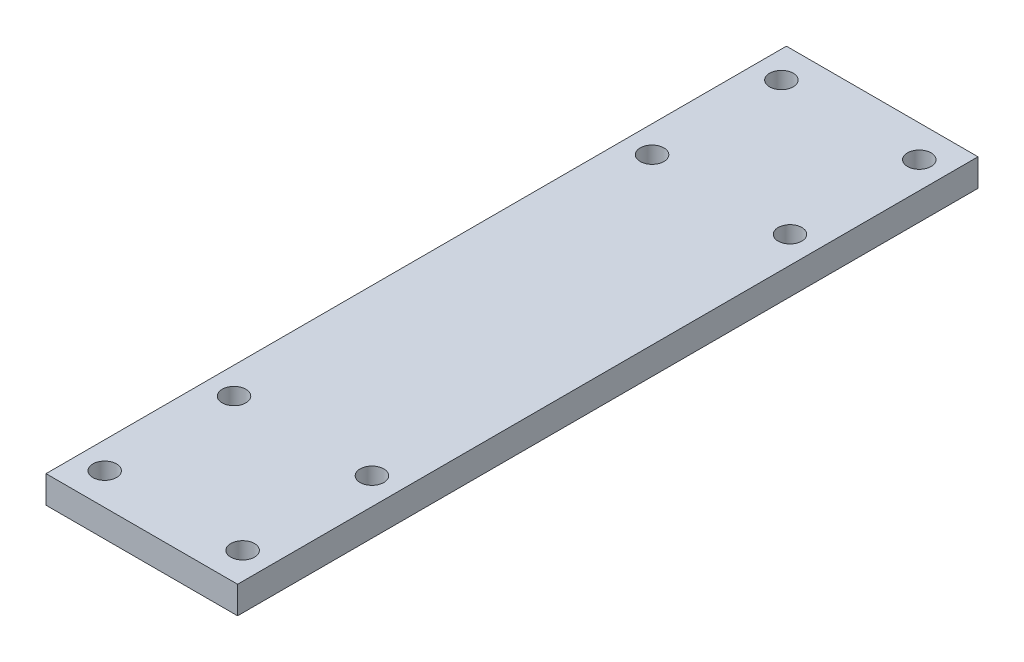
ISO-10303-21;
HEADER;
FILE_DESCRIPTION(('STEP AP214'),'2;1');
FILE_NAME('part.step','',(''),(''),'','','');
FILE_SCHEMA(('AUTOMOTIVE_DESIGN { 1 0 10303 214 1 1 1 1 }'));
ENDSEC;
DATA;
#1=APPLICATION_CONTEXT('core data for automotive mechanical design processes');
#2=APPLICATION_PROTOCOL_DEFINITION('international standard','automotive_design',2000,#1);
#3=PRODUCT_CONTEXT('',#1,'mechanical');
#4=PRODUCT('Part','Part','',(#3));
#5=PRODUCT_RELATED_PRODUCT_CATEGORY('part','',(#4));
#6=PRODUCT_DEFINITION_FORMATION('','',#4);
#7=PRODUCT_DEFINITION_CONTEXT('part definition',#1,'design');
#8=PRODUCT_DEFINITION('design','',#6,#7);
#9=PRODUCT_DEFINITION_SHAPE('','',#8);
#10=(LENGTH_UNIT() NAMED_UNIT(*) SI_UNIT(.MILLI.,.METRE.));
#11=(NAMED_UNIT(*) PLANE_ANGLE_UNIT() SI_UNIT($,.RADIAN.));
#12=(NAMED_UNIT(*) SI_UNIT($,.STERADIAN.) SOLID_ANGLE_UNIT());
#13=UNCERTAINTY_MEASURE_WITH_UNIT(LENGTH_MEASURE(1.E-05),#10,'distance_accuracy_value','');
#14=(GEOMETRIC_REPRESENTATION_CONTEXT(3) GLOBAL_UNCERTAINTY_ASSIGNED_CONTEXT((#13)) GLOBAL_UNIT_ASSIGNED_CONTEXT((#10,
#11,#12)) REPRESENTATION_CONTEXT('',''));
#15=CARTESIAN_POINT('',(0.,0.,0.));
#16=DIRECTION('',(0.,0.,1.));
#17=DIRECTION('',(1.,0.,0.));
#18=AXIS2_PLACEMENT_3D('',#15,#16,#17);
#19=CARTESIAN_POINT('',(22.225,6.35,85.894999914));
#20=DIRECTION('',(-1.,0.,0.));
#21=DIRECTION('',(0.,0.,1.));
#22=AXIS2_PLACEMENT_3D('',#19,#20,#21);
#23=PLANE('',#22);
#24=DIRECTION('',(0.,0.,-1.));
#25=VECTOR('',#24,1.);
#26=CARTESIAN_POINT('',(22.225,0.,85.894999914));
#27=LINE('',#26,#25);
#28=CARTESIAN_POINT('',(22.225,0.,85.894999914));
#29=VERTEX_POINT('',#28);
#30=CARTESIAN_POINT('',(22.225,0.,-85.894999914));
#31=VERTEX_POINT('',#30);
#32=EDGE_CURVE('E102',#29,#31,#27,.T.);
#33=ORIENTED_EDGE('',*,*,#32,.T.);
#34=DIRECTION('',(0.,-1.,0.));
#35=VECTOR('',#34,1.);
#36=CARTESIAN_POINT('',(22.225,6.35,-85.894999914));
#37=LINE('',#36,#35);
#38=CARTESIAN_POINT('',(22.225,6.35,-85.894999914));
#39=VERTEX_POINT('',#38);
#40=EDGE_CURVE('E11',#39,#31,#37,.T.);
#41=ORIENTED_EDGE('',*,*,#40,.F.);
#42=DIRECTION('',(0.,0.,-1.));
#43=VECTOR('',#42,1.);
#44=CARTESIAN_POINT('',(22.225,6.35,85.894999914));
#45=LINE('',#44,#43);
#46=CARTESIAN_POINT('',(22.225,6.35,85.894999914));
#47=VERTEX_POINT('',#46);
#48=EDGE_CURVE('E90',#47,#39,#45,.T.);
#49=ORIENTED_EDGE('',*,*,#48,.F.);
#50=DIRECTION('',(0.,-1.,0.));
#51=VECTOR('',#50,1.);
#52=CARTESIAN_POINT('',(22.225,6.35,85.894999914));
#53=LINE('',#52,#51);
#54=EDGE_CURVE('E98',#47,#29,#53,.T.);
#55=ORIENTED_EDGE('',*,*,#54,.T.);
#56=EDGE_LOOP('',(#33,#41,#49,#55));
#57=FACE_BOUND('',#56,.T.);
#58=ADVANCED_FACE('F39',(#57),#23,.F.);
#59=CARTESIAN_POINT('',(-22.225,6.35,-85.894999914));
#60=DIRECTION('',(0.,0.,1.));
#61=DIRECTION('',(1.,0.,0.));
#62=AXIS2_PLACEMENT_3D('',#59,#60,#61);
#63=PLANE('',#62);
#64=DIRECTION('',(-1.,0.,0.));
#65=VECTOR('',#64,1.);
#66=CARTESIAN_POINT('',(-22.225,0.,-85.894999914));
#67=LINE('',#66,#65);
#68=CARTESIAN_POINT('',(-22.225,0.,-85.894999914));
#69=VERTEX_POINT('',#68);
#70=EDGE_CURVE('E94',#31,#69,#67,.T.);
#71=ORIENTED_EDGE('',*,*,#70,.T.);
#72=DIRECTION('',(0.,-1.,0.));
#73=VECTOR('',#72,1.);
#74=CARTESIAN_POINT('',(-22.225,6.35,-85.894999914));
#75=LINE('',#74,#73);
#76=CARTESIAN_POINT('',(-22.225,6.35,-85.894999914));
#77=VERTEX_POINT('',#76);
#78=EDGE_CURVE('E47',#77,#69,#75,.T.);
#79=ORIENTED_EDGE('',*,*,#78,.F.);
#80=DIRECTION('',(-1.,0.,0.));
#81=VECTOR('',#80,1.);
#82=CARTESIAN_POINT('',(-22.225,6.35,-85.894999914));
#83=LINE('',#82,#81);
#84=EDGE_CURVE('E85',#39,#77,#83,.T.);
#85=ORIENTED_EDGE('',*,*,#84,.F.);
#86=ORIENTED_EDGE('',*,*,#40,.T.);
#87=EDGE_LOOP('',(#71,#79,#85,#86));
#88=FACE_BOUND('',#87,.T.);
#89=ADVANCED_FACE('F93',(#88),#63,.F.);
#90=CARTESIAN_POINT('',(-22.225,6.35,85.894999914));
#91=DIRECTION('',(1.,0.,0.));
#92=DIRECTION('',(0.,0.,-1.));
#93=AXIS2_PLACEMENT_3D('',#90,#91,#92);
#94=PLANE('',#93);
#95=DIRECTION('',(0.,0.,1.));
#96=VECTOR('',#95,1.);
#97=CARTESIAN_POINT('',(-22.225,0.,85.894999914));
#98=LINE('',#97,#96);
#99=CARTESIAN_POINT('',(-22.225,0.,85.894999914));
#100=VERTEX_POINT('',#99);
#101=EDGE_CURVE('E72',#69,#100,#98,.T.);
#102=ORIENTED_EDGE('',*,*,#101,.T.);
#103=DIRECTION('',(0.,-1.,0.));
#104=VECTOR('',#103,1.);
#105=CARTESIAN_POINT('',(-22.225,6.35,85.894999914));
#106=LINE('',#105,#104);
#107=CARTESIAN_POINT('',(-22.225,6.35,85.894999914));
#108=VERTEX_POINT('',#107);
#109=EDGE_CURVE('E95',#108,#100,#106,.T.);
#110=ORIENTED_EDGE('',*,*,#109,.F.);
#111=DIRECTION('',(0.,0.,1.));
#112=VECTOR('',#111,1.);
#113=CARTESIAN_POINT('',(-22.225,6.35,85.894999914));
#114=LINE('',#113,#112);
#115=EDGE_CURVE('E88',#77,#108,#114,.T.);
#116=ORIENTED_EDGE('',*,*,#115,.F.);
#117=ORIENTED_EDGE('',*,*,#78,.T.);
#118=EDGE_LOOP('',(#102,#110,#116,#117));
#119=FACE_BOUND('',#118,.T.);
#120=ADVANCED_FACE('F96',(#119),#94,.F.);
#121=CARTESIAN_POINT('',(-22.225,6.35,85.894999914));
#122=DIRECTION('',(0.,0.,-1.));
#123=DIRECTION('',(-1.,0.,0.));
#124=AXIS2_PLACEMENT_3D('',#121,#122,#123);
#125=PLANE('',#124);
#126=DIRECTION('',(1.,0.,0.));
#127=VECTOR('',#126,1.);
#128=CARTESIAN_POINT('',(-22.225,0.,85.894999914));
#129=LINE('',#128,#127);
#130=EDGE_CURVE('E78',#100,#29,#129,.T.);
#131=ORIENTED_EDGE('',*,*,#130,.T.);
#132=ORIENTED_EDGE('',*,*,#54,.F.);
#133=DIRECTION('',(1.,0.,0.));
#134=VECTOR('',#133,1.);
#135=CARTESIAN_POINT('',(-22.225,6.35,85.894999914));
#136=LINE('',#135,#134);
#137=EDGE_CURVE('E55',#108,#47,#136,.T.);
#138=ORIENTED_EDGE('',*,*,#137,.F.);
#139=ORIENTED_EDGE('',*,*,#109,.T.);
#140=EDGE_LOOP('',(#131,#132,#138,#139));
#141=FACE_BOUND('',#140,.T.);
#142=ADVANCED_FACE('F110',(#141),#125,.F.);
#143=CARTESIAN_POINT('',(0.,6.35,0.));
#144=DIRECTION('',(0.,-1.,0.));
#145=DIRECTION('',(0.,0.,-1.));
#146=AXIS2_PLACEMENT_3D('',#143,#144,#145);
#147=PLANE('',#146);
#148=CARTESIAN_POINT('',(16.,6.35,-78.4999999999999));
#149=DIRECTION('',(0.,1.,0.));
#150=DIRECTION('',(0.,0.,1.));
#151=AXIS2_PLACEMENT_3D('',#148,#149,#150);
#152=CIRCLE('',#151,2.74999999999999);
#153=CARTESIAN_POINT('',(16.,6.35,-75.75));
#154=VERTEX_POINT('',#153);
#155=EDGE_CURVE('E160',#154,#154,#152,.T.);
#156=ORIENTED_EDGE('',*,*,#155,.F.);
#157=EDGE_LOOP('',(#156));
#158=FACE_BOUND('',#157,.T.);
#159=CARTESIAN_POINT('',(16.,6.35,-48.5));
#160=DIRECTION('',(0.,1.,0.));
#161=DIRECTION('',(0.,0.,1.));
#162=AXIS2_PLACEMENT_3D('',#159,#160,#161);
#163=CIRCLE('',#162,2.74999999999999);
#164=CARTESIAN_POINT('',(16.,6.35,-45.75));
#165=VERTEX_POINT('',#164);
#166=EDGE_CURVE('E154',#165,#165,#163,.T.);
#167=ORIENTED_EDGE('',*,*,#166,.F.);
#168=EDGE_LOOP('',(#167));
#169=FACE_BOUND('',#168,.T.);
#170=CARTESIAN_POINT('',(-16.,6.35,-78.4999999999999));
#171=DIRECTION('',(0.,1.,0.));
#172=DIRECTION('',(0.,0.,1.));
#173=AXIS2_PLACEMENT_3D('',#170,#171,#172);
#174=CIRCLE('',#173,2.74999999999999);
#175=CARTESIAN_POINT('',(-16.,6.35,-75.75));
#176=VERTEX_POINT('',#175);
#177=EDGE_CURVE('E148',#176,#176,#174,.T.);
#178=ORIENTED_EDGE('',*,*,#177,.F.);
#179=EDGE_LOOP('',(#178));
#180=FACE_BOUND('',#179,.T.);
#181=CARTESIAN_POINT('',(-16.,6.35,-48.4999999999999));
#182=DIRECTION('',(0.,1.,0.));
#183=DIRECTION('',(0.,0.,1.));
#184=AXIS2_PLACEMENT_3D('',#181,#182,#183);
#185=CIRCLE('',#184,2.74999999999999);
#186=CARTESIAN_POINT('',(-16.,6.35,-45.75));
#187=VERTEX_POINT('',#186);
#188=EDGE_CURVE('E142',#187,#187,#185,.T.);
#189=ORIENTED_EDGE('',*,*,#188,.F.);
#190=EDGE_LOOP('',(#189));
#191=FACE_BOUND('',#190,.T.);
#192=CARTESIAN_POINT('',(16.,6.35,48.5));
#193=DIRECTION('',(0.,1.,0.));
#194=DIRECTION('',(0.,0.,1.));
#195=AXIS2_PLACEMENT_3D('',#192,#193,#194);
#196=CIRCLE('',#195,2.74999999999999);
#197=CARTESIAN_POINT('',(16.,6.35,51.25));
#198=VERTEX_POINT('',#197);
#199=EDGE_CURVE('E136',#198,#198,#196,.T.);
#200=ORIENTED_EDGE('',*,*,#199,.F.);
#201=EDGE_LOOP('',(#200));
#202=FACE_BOUND('',#201,.T.);
#203=CARTESIAN_POINT('',(16.,6.35,78.5));
#204=DIRECTION('',(0.,1.,0.));
#205=DIRECTION('',(0.,0.,1.));
#206=AXIS2_PLACEMENT_3D('',#203,#204,#205);
#207=CIRCLE('',#206,2.74999999999999);
#208=CARTESIAN_POINT('',(16.,6.35,81.25));
#209=VERTEX_POINT('',#208);
#210=EDGE_CURVE('E130',#209,#209,#207,.T.);
#211=ORIENTED_EDGE('',*,*,#210,.F.);
#212=EDGE_LOOP('',(#211));
#213=FACE_BOUND('',#212,.T.);
#214=CARTESIAN_POINT('',(-16.,6.35,78.5));
#215=DIRECTION('',(0.,1.,0.));
#216=DIRECTION('',(0.,0.,1.));
#217=AXIS2_PLACEMENT_3D('',#214,#215,#216);
#218=CIRCLE('',#217,2.74999999999999);
#219=CARTESIAN_POINT('',(-16.,6.35,81.25));
#220=VERTEX_POINT('',#219);
#221=EDGE_CURVE('E124',#220,#220,#218,.T.);
#222=ORIENTED_EDGE('',*,*,#221,.F.);
#223=EDGE_LOOP('',(#222));
#224=FACE_BOUND('',#223,.T.);
#225=CARTESIAN_POINT('',(-16.,6.35,48.5));
#226=DIRECTION('',(0.,1.,0.));
#227=DIRECTION('',(0.,0.,1.));
#228=AXIS2_PLACEMENT_3D('',#225,#226,#227);
#229=CIRCLE('',#228,2.74999999999999);
#230=CARTESIAN_POINT('',(-16.,6.35,51.25));
#231=VERTEX_POINT('',#230);
#232=EDGE_CURVE('E118',#231,#231,#229,.T.);
#233=ORIENTED_EDGE('',*,*,#232,.F.);
#234=EDGE_LOOP('',(#233));
#235=FACE_BOUND('',#234,.T.);
#236=ORIENTED_EDGE('',*,*,#48,.T.);
#237=ORIENTED_EDGE('',*,*,#84,.T.);
#238=ORIENTED_EDGE('',*,*,#115,.T.);
#239=ORIENTED_EDGE('',*,*,#137,.T.);
#240=EDGE_LOOP('',(#236,#237,#238,#239));
#241=FACE_BOUND('',#240,.T.);
#242=ADVANCED_FACE('F86',(#158,#169,#180,#191,#202,#213,#224,#235,#241),#147,.F.);
#243=CARTESIAN_POINT('',(0.,0.,0.));
#244=DIRECTION('',(0.,-1.,0.));
#245=DIRECTION('',(0.,0.,-1.));
#246=AXIS2_PLACEMENT_3D('',#243,#244,#245);
#247=PLANE('',#246);
#248=CARTESIAN_POINT('',(16.,0.,-78.4999999999999));
#249=DIRECTION('',(0.,1.,0.));
#250=DIRECTION('',(0.,0.,1.));
#251=AXIS2_PLACEMENT_3D('',#248,#249,#250);
#252=CIRCLE('',#251,2.75);
#253=CARTESIAN_POINT('',(16.,0.,-75.7499999999999));
#254=VERTEX_POINT('',#253);
#255=EDGE_CURVE('E157',#254,#254,#252,.T.);
#256=ORIENTED_EDGE('',*,*,#255,.T.);
#257=EDGE_LOOP('',(#256));
#258=FACE_BOUND('',#257,.T.);
#259=CARTESIAN_POINT('',(16.,0.,-48.5));
#260=DIRECTION('',(0.,1.,0.));
#261=DIRECTION('',(0.,0.,1.));
#262=AXIS2_PLACEMENT_3D('',#259,#260,#261);
#263=CIRCLE('',#262,2.75);
#264=CARTESIAN_POINT('',(16.,0.,-45.75));
#265=VERTEX_POINT('',#264);
#266=EDGE_CURVE('E151',#265,#265,#263,.T.);
#267=ORIENTED_EDGE('',*,*,#266,.T.);
#268=EDGE_LOOP('',(#267));
#269=FACE_BOUND('',#268,.T.);
#270=CARTESIAN_POINT('',(-16.,0.,-78.4999999999999));
#271=DIRECTION('',(0.,1.,0.));
#272=DIRECTION('',(0.,0.,1.));
#273=AXIS2_PLACEMENT_3D('',#270,#271,#272);
#274=CIRCLE('',#273,2.75);
#275=CARTESIAN_POINT('',(-16.,0.,-75.7499999999999));
#276=VERTEX_POINT('',#275);
#277=EDGE_CURVE('E145',#276,#276,#274,.T.);
#278=ORIENTED_EDGE('',*,*,#277,.T.);
#279=EDGE_LOOP('',(#278));
#280=FACE_BOUND('',#279,.T.);
#281=CARTESIAN_POINT('',(-16.,0.,-48.4999999999999));
#282=DIRECTION('',(0.,1.,0.));
#283=DIRECTION('',(0.,0.,1.));
#284=AXIS2_PLACEMENT_3D('',#281,#282,#283);
#285=CIRCLE('',#284,2.75);
#286=CARTESIAN_POINT('',(-16.,0.,-45.7499999999999));
#287=VERTEX_POINT('',#286);
#288=EDGE_CURVE('E139',#287,#287,#285,.T.);
#289=ORIENTED_EDGE('',*,*,#288,.T.);
#290=EDGE_LOOP('',(#289));
#291=FACE_BOUND('',#290,.T.);
#292=CARTESIAN_POINT('',(16.,0.,48.5));
#293=DIRECTION('',(0.,1.,0.));
#294=DIRECTION('',(0.,0.,1.));
#295=AXIS2_PLACEMENT_3D('',#292,#293,#294);
#296=CIRCLE('',#295,2.75);
#297=CARTESIAN_POINT('',(16.,0.,51.25));
#298=VERTEX_POINT('',#297);
#299=EDGE_CURVE('E133',#298,#298,#296,.T.);
#300=ORIENTED_EDGE('',*,*,#299,.T.);
#301=EDGE_LOOP('',(#300));
#302=FACE_BOUND('',#301,.T.);
#303=CARTESIAN_POINT('',(16.,0.,78.5));
#304=DIRECTION('',(0.,1.,0.));
#305=DIRECTION('',(0.,0.,1.));
#306=AXIS2_PLACEMENT_3D('',#303,#304,#305);
#307=CIRCLE('',#306,2.75);
#308=CARTESIAN_POINT('',(16.,0.,81.25));
#309=VERTEX_POINT('',#308);
#310=EDGE_CURVE('E127',#309,#309,#307,.T.);
#311=ORIENTED_EDGE('',*,*,#310,.T.);
#312=EDGE_LOOP('',(#311));
#313=FACE_BOUND('',#312,.T.);
#314=CARTESIAN_POINT('',(-16.,0.,78.5));
#315=DIRECTION('',(0.,1.,0.));
#316=DIRECTION('',(0.,0.,1.));
#317=AXIS2_PLACEMENT_3D('',#314,#315,#316);
#318=CIRCLE('',#317,2.75);
#319=CARTESIAN_POINT('',(-16.,0.,81.25));
#320=VERTEX_POINT('',#319);
#321=EDGE_CURVE('E121',#320,#320,#318,.T.);
#322=ORIENTED_EDGE('',*,*,#321,.T.);
#323=EDGE_LOOP('',(#322));
#324=FACE_BOUND('',#323,.T.);
#325=CARTESIAN_POINT('',(-16.,0.,48.5));
#326=DIRECTION('',(0.,1.,0.));
#327=DIRECTION('',(0.,0.,1.));
#328=AXIS2_PLACEMENT_3D('',#325,#326,#327);
#329=CIRCLE('',#328,2.75);
#330=CARTESIAN_POINT('',(-16.,0.,51.25));
#331=VERTEX_POINT('',#330);
#332=EDGE_CURVE('E105',#331,#331,#329,.T.);
#333=ORIENTED_EDGE('',*,*,#332,.T.);
#334=EDGE_LOOP('',(#333));
#335=FACE_BOUND('',#334,.T.);
#336=ORIENTED_EDGE('',*,*,#32,.F.);
#337=ORIENTED_EDGE('',*,*,#130,.F.);
#338=ORIENTED_EDGE('',*,*,#101,.F.);
#339=ORIENTED_EDGE('',*,*,#70,.F.);
#340=EDGE_LOOP('',(#336,#337,#338,#339));
#341=FACE_BOUND('',#340,.T.);
#342=ADVANCED_FACE('F113',(#258,#269,#280,#291,#302,#313,#324,#335,#341),#247,.T.);
#343=CARTESIAN_POINT('',(-16.,6.35,48.5));
#344=DIRECTION('',(0.,1.,0.));
#345=DIRECTION('',(0.,0.,1.));
#346=AXIS2_PLACEMENT_3D('',#343,#344,#345);
#347=CYLINDRICAL_SURFACE('',#346,2.74999999999999);
#348=ORIENTED_EDGE('',*,*,#332,.F.);
#349=EDGE_LOOP('',(#348));
#350=FACE_BOUND('',#349,.T.);
#351=ORIENTED_EDGE('',*,*,#232,.T.);
#352=EDGE_LOOP('',(#351));
#353=FACE_BOUND('',#352,.T.);
#354=ADVANCED_FACE('F183',(#350,#353),#347,.F.);
#355=CARTESIAN_POINT('',(-16.,6.35,78.5));
#356=DIRECTION('',(0.,1.,0.));
#357=DIRECTION('',(0.,0.,1.));
#358=AXIS2_PLACEMENT_3D('',#355,#356,#357);
#359=CYLINDRICAL_SURFACE('',#358,2.74999999999999);
#360=ORIENTED_EDGE('',*,*,#321,.F.);
#361=EDGE_LOOP('',(#360));
#362=FACE_BOUND('',#361,.T.);
#363=ORIENTED_EDGE('',*,*,#221,.T.);
#364=EDGE_LOOP('',(#363));
#365=FACE_BOUND('',#364,.T.);
#366=ADVANCED_FACE('F185',(#362,#365),#359,.F.);
#367=CARTESIAN_POINT('',(16.,6.35,78.5));
#368=DIRECTION('',(0.,1.,0.));
#369=DIRECTION('',(0.,0.,1.));
#370=AXIS2_PLACEMENT_3D('',#367,#368,#369);
#371=CYLINDRICAL_SURFACE('',#370,2.74999999999999);
#372=ORIENTED_EDGE('',*,*,#310,.F.);
#373=EDGE_LOOP('',(#372));
#374=FACE_BOUND('',#373,.T.);
#375=ORIENTED_EDGE('',*,*,#210,.T.);
#376=EDGE_LOOP('',(#375));
#377=FACE_BOUND('',#376,.T.);
#378=ADVANCED_FACE('F192',(#374,#377),#371,.F.);
#379=CARTESIAN_POINT('',(16.,6.35,48.5));
#380=DIRECTION('',(0.,1.,0.));
#381=DIRECTION('',(0.,0.,1.));
#382=AXIS2_PLACEMENT_3D('',#379,#380,#381);
#383=CYLINDRICAL_SURFACE('',#382,2.74999999999999);
#384=ORIENTED_EDGE('',*,*,#299,.F.);
#385=EDGE_LOOP('',(#384));
#386=FACE_BOUND('',#385,.T.);
#387=ORIENTED_EDGE('',*,*,#199,.T.);
#388=EDGE_LOOP('',(#387));
#389=FACE_BOUND('',#388,.T.);
#390=ADVANCED_FACE('F239',(#386,#389),#383,.F.);
#391=CARTESIAN_POINT('',(-16.,6.35,-48.4999999999999));
#392=DIRECTION('',(0.,1.,0.));
#393=DIRECTION('',(0.,0.,1.));
#394=AXIS2_PLACEMENT_3D('',#391,#392,#393);
#395=CYLINDRICAL_SURFACE('',#394,2.74999999999999);
#396=ORIENTED_EDGE('',*,*,#288,.F.);
#397=EDGE_LOOP('',(#396));
#398=FACE_BOUND('',#397,.T.);
#399=ORIENTED_EDGE('',*,*,#188,.T.);
#400=EDGE_LOOP('',(#399));
#401=FACE_BOUND('',#400,.T.);
#402=ADVANCED_FACE('F249',(#398,#401),#395,.F.);
#403=CARTESIAN_POINT('',(-16.,6.35,-78.4999999999999));
#404=DIRECTION('',(0.,1.,0.));
#405=DIRECTION('',(0.,0.,1.));
#406=AXIS2_PLACEMENT_3D('',#403,#404,#405);
#407=CYLINDRICAL_SURFACE('',#406,2.74999999999999);
#408=ORIENTED_EDGE('',*,*,#277,.F.);
#409=EDGE_LOOP('',(#408));
#410=FACE_BOUND('',#409,.T.);
#411=ORIENTED_EDGE('',*,*,#177,.T.);
#412=EDGE_LOOP('',(#411));
#413=FACE_BOUND('',#412,.T.);
#414=ADVANCED_FACE('F259',(#410,#413),#407,.F.);
#415=CARTESIAN_POINT('',(16.,6.35,-48.5));
#416=DIRECTION('',(0.,1.,0.));
#417=DIRECTION('',(0.,0.,1.));
#418=AXIS2_PLACEMENT_3D('',#415,#416,#417);
#419=CYLINDRICAL_SURFACE('',#418,2.74999999999999);
#420=ORIENTED_EDGE('',*,*,#266,.F.);
#421=EDGE_LOOP('',(#420));
#422=FACE_BOUND('',#421,.T.);
#423=ORIENTED_EDGE('',*,*,#166,.T.);
#424=EDGE_LOOP('',(#423));
#425=FACE_BOUND('',#424,.T.);
#426=ADVANCED_FACE('F269',(#422,#425),#419,.F.);
#427=CARTESIAN_POINT('',(16.,6.35,-78.4999999999999));
#428=DIRECTION('',(0.,1.,0.));
#429=DIRECTION('',(0.,0.,1.));
#430=AXIS2_PLACEMENT_3D('',#427,#428,#429);
#431=CYLINDRICAL_SURFACE('',#430,2.74999999999999);
#432=ORIENTED_EDGE('',*,*,#255,.F.);
#433=EDGE_LOOP('',(#432));
#434=FACE_BOUND('',#433,.T.);
#435=ORIENTED_EDGE('',*,*,#155,.T.);
#436=EDGE_LOOP('',(#435));
#437=FACE_BOUND('',#436,.T.);
#438=ADVANCED_FACE('F164',(#434,#437),#431,.F.);
#439=CLOSED_SHELL('',(#58,#89,#120,#142,#242,#342,#354,#366,#378,#390,#402,#414,#426,#438));
#440=MANIFOLD_SOLID_BREP('B2',#439);
#441=ADVANCED_BREP_SHAPE_REPRESENTATION('',(#18,#440),#14);
#442=SHAPE_DEFINITION_REPRESENTATION(#9,#441);
ENDSEC;
END-ISO-10303-21;
